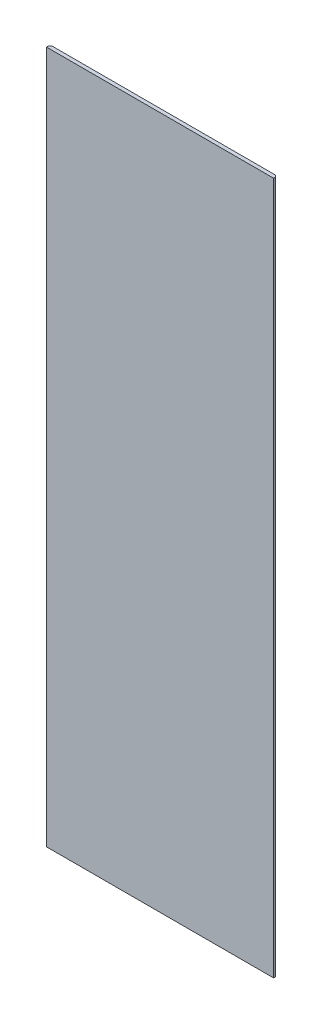
ISO-10303-21;
HEADER;
FILE_DESCRIPTION(('STEP AP214'),'2;1');
FILE_NAME('part.step','',(''),(''),'','','');
FILE_SCHEMA(('AUTOMOTIVE_DESIGN { 1 0 10303 214 1 1 1 1 }'));
ENDSEC;
DATA;
#1=APPLICATION_CONTEXT('core data for automotive mechanical design processes');
#2=APPLICATION_PROTOCOL_DEFINITION('international standard','automotive_design',2000,#1);
#3=PRODUCT_CONTEXT('',#1,'mechanical');
#4=PRODUCT('Part','Part','',(#3));
#5=PRODUCT_RELATED_PRODUCT_CATEGORY('part','',(#4));
#6=PRODUCT_DEFINITION_FORMATION('','',#4);
#7=PRODUCT_DEFINITION_CONTEXT('part definition',#1,'design');
#8=PRODUCT_DEFINITION('design','',#6,#7);
#9=PRODUCT_DEFINITION_SHAPE('','',#8);
#10=(LENGTH_UNIT() NAMED_UNIT(*) SI_UNIT(.MILLI.,.METRE.));
#11=(NAMED_UNIT(*) PLANE_ANGLE_UNIT() SI_UNIT($,.RADIAN.));
#12=(NAMED_UNIT(*) SI_UNIT($,.STERADIAN.) SOLID_ANGLE_UNIT());
#13=UNCERTAINTY_MEASURE_WITH_UNIT(LENGTH_MEASURE(1.E-05),#10,'distance_accuracy_value','');
#14=(GEOMETRIC_REPRESENTATION_CONTEXT(3) GLOBAL_UNCERTAINTY_ASSIGNED_CONTEXT((#13)) GLOBAL_UNIT_ASSIGNED_CONTEXT((#10,
#11,#12)) REPRESENTATION_CONTEXT('',''));
#15=CARTESIAN_POINT('',(0.,0.,0.));
#16=DIRECTION('',(0.,0.,1.));
#17=DIRECTION('',(1.,0.,0.));
#18=AXIS2_PLACEMENT_3D('',#15,#16,#17);
#19=CARTESIAN_POINT('',(-49.20625,-150.,0.79375));
#20=DIRECTION('',(1.,0.,0.));
#21=DIRECTION('',(0.,0.,-1.));
#22=AXIS2_PLACEMENT_3D('',#19,#20,#21);
#23=PLANE('',#22);
#24=DIRECTION('',(0.,0.,-1.));
#25=VECTOR('',#24,1.);
#26=CARTESIAN_POINT('',(-49.20625,150.,0.79375));
#27=LINE('',#26,#25);
#28=CARTESIAN_POINT('',(-49.20625,150.,0.79375));
#29=VERTEX_POINT('',#28);
#30=CARTESIAN_POINT('',(-49.20625,150.,0.));
#31=VERTEX_POINT('',#30);
#32=EDGE_CURVE('E155',#29,#31,#27,.T.);
#33=ORIENTED_EDGE('',*,*,#32,.T.);
#34=DIRECTION('',(0.,-1.,0.));
#35=VECTOR('',#34,1.);
#36=CARTESIAN_POINT('',(-49.20625,-150.,0.));
#37=LINE('',#36,#35);
#38=CARTESIAN_POINT('',(-49.20625,-150.,0.));
#39=VERTEX_POINT('',#38);
#40=EDGE_CURVE('E129',#31,#39,#37,.T.);
#41=ORIENTED_EDGE('',*,*,#40,.T.);
#42=DIRECTION('',(0.,0.,-1.));
#43=VECTOR('',#42,1.);
#44=CARTESIAN_POINT('',(-49.20625,-150.,0.79375));
#45=LINE('',#44,#43);
#46=CARTESIAN_POINT('',(-49.20625,-150.,0.79375));
#47=VERTEX_POINT('',#46);
#48=EDGE_CURVE('E108',#47,#39,#45,.T.);
#49=ORIENTED_EDGE('',*,*,#48,.F.);
#50=DIRECTION('',(0.,-1.,0.));
#51=VECTOR('',#50,1.);
#52=CARTESIAN_POINT('',(-49.20625,-150.,0.79375));
#53=LINE('',#52,#51);
#54=EDGE_CURVE('E115',#29,#47,#53,.T.);
#55=ORIENTED_EDGE('',*,*,#54,.F.);
#56=EDGE_LOOP('',(#33,#41,#49,#55));
#57=FACE_BOUND('',#56,.T.);
#58=ADVANCED_FACE('F47',(#57),#23,.F.);
#59=CARTESIAN_POINT('',(49.20625,-150.,0.79375));
#60=DIRECTION('',(0.,1.,0.));
#61=DIRECTION('',(0.,0.,1.));
#62=AXIS2_PLACEMENT_3D('',#59,#60,#61);
#63=PLANE('',#62);
#64=ORIENTED_EDGE('',*,*,#48,.T.);
#65=DIRECTION('',(-0.70710678118656,0.,0.707106781186535));
#66=VECTOR('',#65,1.);
#67=CARTESIAN_POINT('',(-49.20625,-150.,0.));
#68=LINE('',#67,#66);
#69=CARTESIAN_POINT('',(-48.4125,-150.,-0.79375));
#70=VERTEX_POINT('',#69);
#71=EDGE_CURVE('E142',#39,#70,#68,.F.);
#72=ORIENTED_EDGE('',*,*,#71,.T.);
#73=DIRECTION('',(1.,0.,0.));
#74=VECTOR('',#73,1.);
#75=CARTESIAN_POINT('',(49.20625,-150.,-0.79375));
#76=LINE('',#75,#74);
#77=CARTESIAN_POINT('',(48.4125,-150.,-0.79375));
#78=VERTEX_POINT('',#77);
#79=EDGE_CURVE('E161',#70,#78,#76,.T.);
#80=ORIENTED_EDGE('',*,*,#79,.T.);
#81=DIRECTION('',(-0.70710678118656,0.,-0.707106781186535));
#82=VECTOR('',#81,1.);
#83=CARTESIAN_POINT('',(49.20625,-150.,0.));
#84=LINE('',#83,#82);
#85=CARTESIAN_POINT('',(49.20625,-150.,0.));
#86=VERTEX_POINT('',#85);
#87=EDGE_CURVE('E134',#78,#86,#84,.F.);
#88=ORIENTED_EDGE('',*,*,#87,.T.);
#89=DIRECTION('',(0.,0.,-1.));
#90=VECTOR('',#89,1.);
#91=CARTESIAN_POINT('',(49.20625,-150.,0.79375));
#92=LINE('',#91,#90);
#93=CARTESIAN_POINT('',(49.20625,-150.,0.79375));
#94=VERTEX_POINT('',#93);
#95=EDGE_CURVE('E110',#94,#86,#92,.T.);
#96=ORIENTED_EDGE('',*,*,#95,.F.);
#97=DIRECTION('',(1.,0.,0.));
#98=VECTOR('',#97,1.);
#99=CARTESIAN_POINT('',(49.20625,-150.,0.79375));
#100=LINE('',#99,#98);
#101=EDGE_CURVE('E104',#47,#94,#100,.T.);
#102=ORIENTED_EDGE('',*,*,#101,.F.);
#103=EDGE_LOOP('',(#64,#72,#80,#88,#96,#102));
#104=FACE_BOUND('',#103,.T.);
#105=ADVANCED_FACE('F106',(#104),#63,.F.);
#106=CARTESIAN_POINT('',(49.20625,-150.,0.79375));
#107=DIRECTION('',(-1.,0.,0.));
#108=DIRECTION('',(0.,0.,1.));
#109=AXIS2_PLACEMENT_3D('',#106,#107,#108);
#110=PLANE('',#109);
#111=ORIENTED_EDGE('',*,*,#95,.T.);
#112=DIRECTION('',(0.,1.,0.));
#113=VECTOR('',#112,1.);
#114=CARTESIAN_POINT('',(49.20625,-150.,0.));
#115=LINE('',#114,#113);
#116=CARTESIAN_POINT('',(49.20625,150.,0.));
#117=VERTEX_POINT('',#116);
#118=EDGE_CURVE('E11',#86,#117,#115,.T.);
#119=ORIENTED_EDGE('',*,*,#118,.T.);
#120=DIRECTION('',(0.,0.,-1.));
#121=VECTOR('',#120,1.);
#122=CARTESIAN_POINT('',(49.20625,150.,0.79375));
#123=LINE('',#122,#121);
#124=CARTESIAN_POINT('',(49.20625,150.,0.79375));
#125=VERTEX_POINT('',#124);
#126=EDGE_CURVE('E136',#125,#117,#123,.T.);
#127=ORIENTED_EDGE('',*,*,#126,.F.);
#128=DIRECTION('',(0.,1.,0.));
#129=VECTOR('',#128,1.);
#130=CARTESIAN_POINT('',(49.20625,-150.,0.79375));
#131=LINE('',#130,#129);
#132=EDGE_CURVE('E114',#94,#125,#131,.T.);
#133=ORIENTED_EDGE('',*,*,#132,.F.);
#134=EDGE_LOOP('',(#111,#119,#127,#133));
#135=FACE_BOUND('',#134,.T.);
#136=ADVANCED_FACE('F174',(#135),#110,.F.);
#137=CARTESIAN_POINT('',(49.20625,150.,0.79375));
#138=DIRECTION('',(0.,-1.,0.));
#139=DIRECTION('',(0.,0.,-1.));
#140=AXIS2_PLACEMENT_3D('',#137,#138,#139);
#141=PLANE('',#140);
#142=DIRECTION('',(-1.,0.,0.));
#143=VECTOR('',#142,1.);
#144=CARTESIAN_POINT('',(49.20625,150.,-0.79375));
#145=LINE('',#144,#143);
#146=CARTESIAN_POINT('',(48.4125,150.,-0.79375));
#147=VERTEX_POINT('',#146);
#148=CARTESIAN_POINT('',(-48.4125,150.,-0.79375));
#149=VERTEX_POINT('',#148);
#150=EDGE_CURVE('E125',#147,#149,#145,.T.);
#151=ORIENTED_EDGE('',*,*,#150,.T.);
#152=DIRECTION('',(0.70710678118656,0.,-0.707106781186535));
#153=VECTOR('',#152,1.);
#154=CARTESIAN_POINT('',(-49.20625,150.,0.));
#155=LINE('',#154,#153);
#156=EDGE_CURVE('E57',#149,#31,#155,.F.);
#157=ORIENTED_EDGE('',*,*,#156,.T.);
#158=ORIENTED_EDGE('',*,*,#32,.F.);
#159=DIRECTION('',(-1.,0.,0.));
#160=VECTOR('',#159,1.);
#161=CARTESIAN_POINT('',(49.20625,150.,0.79375));
#162=LINE('',#161,#160);
#163=EDGE_CURVE('E120',#125,#29,#162,.T.);
#164=ORIENTED_EDGE('',*,*,#163,.F.);
#165=ORIENTED_EDGE('',*,*,#126,.T.);
#166=DIRECTION('',(0.70710678118656,0.,0.707106781186535));
#167=VECTOR('',#166,1.);
#168=CARTESIAN_POINT('',(49.20625,150.,0.));
#169=LINE('',#168,#167);
#170=EDGE_CURVE('E64',#117,#147,#169,.F.);
#171=ORIENTED_EDGE('',*,*,#170,.T.);
#172=EDGE_LOOP('',(#151,#157,#158,#164,#165,#171));
#173=FACE_BOUND('',#172,.T.);
#174=ADVANCED_FACE('F154',(#173),#141,.F.);
#175=CARTESIAN_POINT('',(0.,0.,0.79375));
#176=DIRECTION('',(0.,0.,1.));
#177=DIRECTION('',(1.,0.,0.));
#178=AXIS2_PLACEMENT_3D('',#175,#176,#177);
#179=PLANE('',#178);
#180=ORIENTED_EDGE('',*,*,#54,.T.);
#181=ORIENTED_EDGE('',*,*,#101,.T.);
#182=ORIENTED_EDGE('',*,*,#132,.T.);
#183=ORIENTED_EDGE('',*,*,#163,.T.);
#184=EDGE_LOOP('',(#180,#181,#182,#183));
#185=FACE_BOUND('',#184,.T.);
#186=ADVANCED_FACE('F118',(#185),#179,.T.);
#187=CARTESIAN_POINT('',(0.,0.,-0.79375));
#188=DIRECTION('',(0.,0.,1.));
#189=DIRECTION('',(1.,0.,0.));
#190=AXIS2_PLACEMENT_3D('',#187,#188,#189);
#191=PLANE('',#190);
#192=ORIENTED_EDGE('',*,*,#79,.F.);
#193=DIRECTION('',(0.,1.,0.));
#194=VECTOR('',#193,1.);
#195=CARTESIAN_POINT('',(-48.4125,0.,-0.79375));
#196=LINE('',#195,#194);
#197=EDGE_CURVE('E71',#70,#149,#196,.T.);
#198=ORIENTED_EDGE('',*,*,#197,.T.);
#199=ORIENTED_EDGE('',*,*,#150,.F.);
#200=DIRECTION('',(0.,-1.,0.));
#201=VECTOR('',#200,1.);
#202=CARTESIAN_POINT('',(48.4125,0.,-0.79375));
#203=LINE('',#202,#201);
#204=EDGE_CURVE('E145',#147,#78,#203,.T.);
#205=ORIENTED_EDGE('',*,*,#204,.T.);
#206=EDGE_LOOP('',(#192,#198,#199,#205));
#207=FACE_BOUND('',#206,.T.);
#208=ADVANCED_FACE('F163',(#207),#191,.F.);
#209=CARTESIAN_POINT('',(-49.20625,-150.,0.));
#210=DIRECTION('',(0.707106781186535,0.,0.70710678118656));
#211=DIRECTION('',(0.,-1.,0.));
#212=AXIS2_PLACEMENT_3D('',#209,#210,#211);
#213=PLANE('',#212);
#214=ORIENTED_EDGE('',*,*,#156,.F.);
#215=ORIENTED_EDGE('',*,*,#197,.F.);
#216=ORIENTED_EDGE('',*,*,#71,.F.);
#217=ORIENTED_EDGE('',*,*,#40,.F.);
#218=EDGE_LOOP('',(#214,#215,#216,#217));
#219=FACE_BOUND('',#218,.T.);
#220=ADVANCED_FACE('F159',(#219),#213,.F.);
#221=CARTESIAN_POINT('',(49.20625,-150.,0.));
#222=DIRECTION('',(-0.707106781186535,0.,0.70710678118656));
#223=DIRECTION('',(0.,1.,0.));
#224=AXIS2_PLACEMENT_3D('',#221,#222,#223);
#225=PLANE('',#224);
#226=ORIENTED_EDGE('',*,*,#87,.F.);
#227=ORIENTED_EDGE('',*,*,#204,.F.);
#228=ORIENTED_EDGE('',*,*,#170,.F.);
#229=ORIENTED_EDGE('',*,*,#118,.F.);
#230=EDGE_LOOP('',(#226,#227,#228,#229));
#231=FACE_BOUND('',#230,.T.);
#232=ADVANCED_FACE('F50',(#231),#225,.F.);
#233=CLOSED_SHELL('',(#58,#105,#136,#174,#186,#208,#220,#232));
#234=MANIFOLD_SOLID_BREP('B2',#233);
#235=ADVANCED_BREP_SHAPE_REPRESENTATION('',(#18,#234),#14);
#236=SHAPE_DEFINITION_REPRESENTATION(#9,#235);
ENDSEC;
END-ISO-10303-21;
